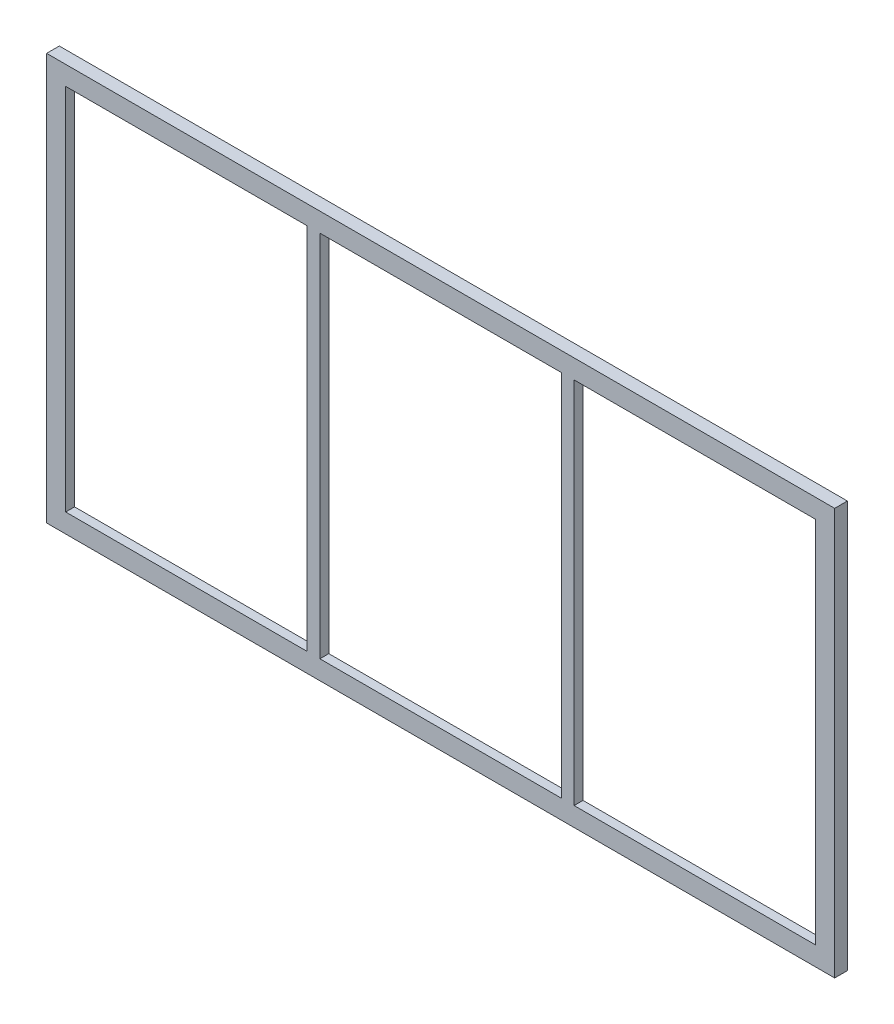
ISO-10303-21;
HEADER;
FILE_DESCRIPTION(('STEP AP214'),'2;1');
FILE_NAME('part.step','',(''),(''),'','','');
FILE_SCHEMA(('AUTOMOTIVE_DESIGN { 1 0 10303 214 1 1 1 1 }'));
ENDSEC;
DATA;
#1=APPLICATION_CONTEXT('core data for automotive mechanical design processes');
#2=APPLICATION_PROTOCOL_DEFINITION('international standard','automotive_design',2000,#1);
#3=PRODUCT_CONTEXT('',#1,'mechanical');
#4=PRODUCT('Part','Part','',(#3));
#5=PRODUCT_RELATED_PRODUCT_CATEGORY('part','',(#4));
#6=PRODUCT_DEFINITION_FORMATION('','',#4);
#7=PRODUCT_DEFINITION_CONTEXT('part definition',#1,'design');
#8=PRODUCT_DEFINITION('design','',#6,#7);
#9=PRODUCT_DEFINITION_SHAPE('','',#8);
#10=(LENGTH_UNIT() NAMED_UNIT(*) SI_UNIT(.MILLI.,.METRE.));
#11=(NAMED_UNIT(*) PLANE_ANGLE_UNIT() SI_UNIT($,.RADIAN.));
#12=(NAMED_UNIT(*) SI_UNIT($,.STERADIAN.) SOLID_ANGLE_UNIT());
#13=UNCERTAINTY_MEASURE_WITH_UNIT(LENGTH_MEASURE(1.E-05),#10,'distance_accuracy_value','');
#14=(GEOMETRIC_REPRESENTATION_CONTEXT(3) GLOBAL_UNCERTAINTY_ASSIGNED_CONTEXT((#13)) GLOBAL_UNIT_ASSIGNED_CONTEXT((#10,
#11,#12)) REPRESENTATION_CONTEXT('',''));
#15=CARTESIAN_POINT('',(0.,0.,0.));
#16=DIRECTION('',(0.,0.,1.));
#17=DIRECTION('',(1.,0.,0.));
#18=AXIS2_PLACEMENT_3D('',#15,#16,#17);
#19=CARTESIAN_POINT('',(5.,5.,10.));
#20=DIRECTION('',(1.,0.,0.));
#21=DIRECTION('',(0.,0.,-1.));
#22=AXIS2_PLACEMENT_3D('',#19,#20,#21);
#23=PLANE('',#22);
#24=DIRECTION('',(0.,0.,-1.));
#25=VECTOR('',#24,1.);
#26=CARTESIAN_POINT('',(5.,5.,10.));
#27=LINE('',#26,#25);
#28=CARTESIAN_POINT('',(5.,5.,10.));
#29=VERTEX_POINT('',#28);
#30=CARTESIAN_POINT('',(5.,5.,3.));
#31=VERTEX_POINT('',#30);
#32=EDGE_CURVE('E297',#29,#31,#27,.T.);
#33=ORIENTED_EDGE('',*,*,#32,.T.);
#34=DIRECTION('',(0.,1.,0.));
#35=VECTOR('',#34,1.);
#36=CARTESIAN_POINT('',(5.,5.,3.));
#37=LINE('',#36,#35);
#38=CARTESIAN_POINT('',(5.,295.,3.));
#39=VERTEX_POINT('',#38);
#40=EDGE_CURVE('E234',#31,#39,#37,.T.);
#41=ORIENTED_EDGE('',*,*,#40,.T.);
#42=DIRECTION('',(0.,0.,-1.));
#43=VECTOR('',#42,1.);
#44=CARTESIAN_POINT('',(5.,295.,10.));
#45=LINE('',#44,#43);
#46=CARTESIAN_POINT('',(5.,295.,10.));
#47=VERTEX_POINT('',#46);
#48=EDGE_CURVE('E288',#47,#39,#45,.T.);
#49=ORIENTED_EDGE('',*,*,#48,.F.);
#50=DIRECTION('',(0.,-1.,0.));
#51=VECTOR('',#50,1.);
#52=CARTESIAN_POINT('',(5.,5.,10.));
#53=LINE('',#52,#51);
#54=EDGE_CURVE('E279',#47,#29,#53,.T.);
#55=ORIENTED_EDGE('',*,*,#54,.T.);
#56=EDGE_LOOP('',(#33,#41,#49,#55));
#57=FACE_BOUND('',#56,.T.);
#58=ADVANCED_FACE('F32',(#57),#23,.T.);
#59=CARTESIAN_POINT('',(5.,5.,10.));
#60=DIRECTION('',(0.,1.,0.));
#61=DIRECTION('',(-1.,0.,0.));
#62=AXIS2_PLACEMENT_3D('',#59,#60,#61);
#63=PLANE('',#62);
#64=DIRECTION('',(0.,0.,-1.));
#65=VECTOR('',#64,1.);
#66=CARTESIAN_POINT('',(195.,5.,10.));
#67=LINE('',#66,#65);
#68=CARTESIAN_POINT('',(195.,5.,10.));
#69=VERTEX_POINT('',#68);
#70=CARTESIAN_POINT('',(195.,5.,3.));
#71=VERTEX_POINT('',#70);
#72=EDGE_CURVE('E294',#69,#71,#67,.T.);
#73=ORIENTED_EDGE('',*,*,#72,.T.);
#74=DIRECTION('',(-1.,0.,0.));
#75=VECTOR('',#74,1.);
#76=CARTESIAN_POINT('',(5.,5.,3.));
#77=LINE('',#76,#75);
#78=EDGE_CURVE('E231',#71,#31,#77,.T.);
#79=ORIENTED_EDGE('',*,*,#78,.T.);
#80=ORIENTED_EDGE('',*,*,#32,.F.);
#81=DIRECTION('',(1.,0.,0.));
#82=VECTOR('',#81,1.);
#83=CARTESIAN_POINT('',(5.,5.,10.));
#84=LINE('',#83,#82);
#85=EDGE_CURVE('E281',#29,#69,#84,.T.);
#86=ORIENTED_EDGE('',*,*,#85,.T.);
#87=EDGE_LOOP('',(#73,#79,#80,#86));
#88=FACE_BOUND('',#87,.T.);
#89=ADVANCED_FACE('F380',(#88),#63,.T.);
#90=CARTESIAN_POINT('',(195.,295.,10.));
#91=DIRECTION('',(-1.,0.,0.));
#92=DIRECTION('',(0.,0.,1.));
#93=AXIS2_PLACEMENT_3D('',#90,#91,#92);
#94=PLANE('',#93);
#95=DIRECTION('',(0.,0.,-1.));
#96=VECTOR('',#95,1.);
#97=CARTESIAN_POINT('',(195.,295.,10.));
#98=LINE('',#97,#96);
#99=CARTESIAN_POINT('',(195.,295.,10.));
#100=VERTEX_POINT('',#99);
#101=CARTESIAN_POINT('',(195.,295.,3.));
#102=VERTEX_POINT('',#101);
#103=EDGE_CURVE('E291',#100,#102,#98,.T.);
#104=ORIENTED_EDGE('',*,*,#103,.T.);
#105=DIRECTION('',(0.,-1.,0.));
#106=VECTOR('',#105,1.);
#107=CARTESIAN_POINT('',(195.,295.,3.));
#108=LINE('',#107,#106);
#109=EDGE_CURVE('E55',#102,#71,#108,.T.);
#110=ORIENTED_EDGE('',*,*,#109,.T.);
#111=ORIENTED_EDGE('',*,*,#72,.F.);
#112=DIRECTION('',(0.,1.,0.));
#113=VECTOR('',#112,1.);
#114=CARTESIAN_POINT('',(195.,295.,10.));
#115=LINE('',#114,#113);
#116=EDGE_CURVE('E283',#69,#100,#115,.T.);
#117=ORIENTED_EDGE('',*,*,#116,.T.);
#118=EDGE_LOOP('',(#104,#110,#111,#117));
#119=FACE_BOUND('',#118,.T.);
#120=ADVANCED_FACE('F386',(#119),#94,.T.);
#121=CARTESIAN_POINT('',(5.,295.,10.));
#122=DIRECTION('',(0.,-1.,0.));
#123=DIRECTION('',(0.,0.,-1.));
#124=AXIS2_PLACEMENT_3D('',#121,#122,#123);
#125=PLANE('',#124);
#126=ORIENTED_EDGE('',*,*,#48,.T.);
#127=DIRECTION('',(1.,0.,0.));
#128=VECTOR('',#127,1.);
#129=CARTESIAN_POINT('',(5.,295.,3.));
#130=LINE('',#129,#128);
#131=EDGE_CURVE('E228',#39,#102,#130,.T.);
#132=ORIENTED_EDGE('',*,*,#131,.T.);
#133=ORIENTED_EDGE('',*,*,#103,.F.);
#134=DIRECTION('',(-1.,0.,0.));
#135=VECTOR('',#134,1.);
#136=CARTESIAN_POINT('',(5.,295.,10.));
#137=LINE('',#136,#135);
#138=EDGE_CURVE('E286',#100,#47,#137,.T.);
#139=ORIENTED_EDGE('',*,*,#138,.T.);
#140=EDGE_LOOP('',(#126,#132,#133,#139));
#141=FACE_BOUND('',#140,.T.);
#142=ADVANCED_FACE('F491',(#141),#125,.T.);
#143=CARTESIAN_POINT('',(405.,295.,10.));
#144=DIRECTION('',(0.,-1.,0.));
#145=DIRECTION('',(0.,0.,-1.));
#146=AXIS2_PLACEMENT_3D('',#143,#144,#145);
#147=PLANE('',#146);
#148=DIRECTION('',(0.,0.,-1.));
#149=VECTOR('',#148,1.);
#150=CARTESIAN_POINT('',(405.,295.,10.));
#151=LINE('',#150,#149);
#152=CARTESIAN_POINT('',(405.,295.,10.));
#153=VERTEX_POINT('',#152);
#154=CARTESIAN_POINT('',(405.,295.,3.));
#155=VERTEX_POINT('',#154);
#156=EDGE_CURVE('E276',#153,#155,#151,.T.);
#157=ORIENTED_EDGE('',*,*,#156,.T.);
#158=DIRECTION('',(1.,0.,0.));
#159=VECTOR('',#158,1.);
#160=CARTESIAN_POINT('',(405.,295.,3.));
#161=LINE('',#160,#159);
#162=CARTESIAN_POINT('',(595.,295.,3.));
#163=VERTEX_POINT('',#162);
#164=EDGE_CURVE('E225',#155,#163,#161,.T.);
#165=ORIENTED_EDGE('',*,*,#164,.T.);
#166=DIRECTION('',(0.,0.,-1.));
#167=VECTOR('',#166,1.);
#168=CARTESIAN_POINT('',(595.,295.,10.));
#169=LINE('',#168,#167);
#170=CARTESIAN_POINT('',(595.,295.,10.));
#171=VERTEX_POINT('',#170);
#172=EDGE_CURVE('E267',#171,#163,#169,.T.);
#173=ORIENTED_EDGE('',*,*,#172,.F.);
#174=DIRECTION('',(-1.,0.,0.));
#175=VECTOR('',#174,1.);
#176=CARTESIAN_POINT('',(405.,295.,10.));
#177=LINE('',#176,#175);
#178=EDGE_CURVE('E258',#171,#153,#177,.T.);
#179=ORIENTED_EDGE('',*,*,#178,.T.);
#180=EDGE_LOOP('',(#157,#165,#173,#179));
#181=FACE_BOUND('',#180,.T.);
#182=ADVANCED_FACE('F482',(#181),#147,.T.);
#183=CARTESIAN_POINT('',(405.,295.,10.));
#184=DIRECTION('',(1.,0.,0.));
#185=DIRECTION('',(0.,0.,-1.));
#186=AXIS2_PLACEMENT_3D('',#183,#184,#185);
#187=PLANE('',#186);
#188=DIRECTION('',(0.,0.,-1.));
#189=VECTOR('',#188,1.);
#190=CARTESIAN_POINT('',(405.,5.,10.));
#191=LINE('',#190,#189);
#192=CARTESIAN_POINT('',(405.,5.,10.));
#193=VERTEX_POINT('',#192);
#194=CARTESIAN_POINT('',(405.,5.,3.));
#195=VERTEX_POINT('',#194);
#196=EDGE_CURVE('E273',#193,#195,#191,.T.);
#197=ORIENTED_EDGE('',*,*,#196,.T.);
#198=DIRECTION('',(0.,1.,0.));
#199=VECTOR('',#198,1.);
#200=CARTESIAN_POINT('',(405.,295.,3.));
#201=LINE('',#200,#199);
#202=EDGE_CURVE('E222',#195,#155,#201,.T.);
#203=ORIENTED_EDGE('',*,*,#202,.T.);
#204=ORIENTED_EDGE('',*,*,#156,.F.);
#205=DIRECTION('',(0.,-1.,0.));
#206=VECTOR('',#205,1.);
#207=CARTESIAN_POINT('',(405.,295.,10.));
#208=LINE('',#207,#206);
#209=EDGE_CURVE('E260',#153,#193,#208,.T.);
#210=ORIENTED_EDGE('',*,*,#209,.T.);
#211=EDGE_LOOP('',(#197,#203,#204,#210));
#212=FACE_BOUND('',#211,.T.);
#213=ADVANCED_FACE('F473',(#212),#187,.T.);
#214=CARTESIAN_POINT('',(405.,5.,10.));
#215=DIRECTION('',(0.,1.,0.));
#216=DIRECTION('',(-1.,0.,0.));
#217=AXIS2_PLACEMENT_3D('',#214,#215,#216);
#218=PLANE('',#217);
#219=DIRECTION('',(0.,0.,-1.));
#220=VECTOR('',#219,1.);
#221=CARTESIAN_POINT('',(595.,5.,10.));
#222=LINE('',#221,#220);
#223=CARTESIAN_POINT('',(595.,5.,10.));
#224=VERTEX_POINT('',#223);
#225=CARTESIAN_POINT('',(595.,5.,3.));
#226=VERTEX_POINT('',#225);
#227=EDGE_CURVE('E270',#224,#226,#222,.T.);
#228=ORIENTED_EDGE('',*,*,#227,.T.);
#229=DIRECTION('',(-1.,0.,0.));
#230=VECTOR('',#229,1.);
#231=CARTESIAN_POINT('',(405.,5.,3.));
#232=LINE('',#231,#230);
#233=EDGE_CURVE('E219',#226,#195,#232,.T.);
#234=ORIENTED_EDGE('',*,*,#233,.T.);
#235=ORIENTED_EDGE('',*,*,#196,.F.);
#236=DIRECTION('',(1.,0.,0.));
#237=VECTOR('',#236,1.);
#238=CARTESIAN_POINT('',(405.,5.,10.));
#239=LINE('',#238,#237);
#240=EDGE_CURVE('E262',#193,#224,#239,.T.);
#241=ORIENTED_EDGE('',*,*,#240,.T.);
#242=EDGE_LOOP('',(#228,#234,#235,#241));
#243=FACE_BOUND('',#242,.T.);
#244=ADVANCED_FACE('F464',(#243),#218,.T.);
#245=CARTESIAN_POINT('',(595.,5.,10.));
#246=DIRECTION('',(-1.,0.,0.));
#247=DIRECTION('',(0.,0.,1.));
#248=AXIS2_PLACEMENT_3D('',#245,#246,#247);
#249=PLANE('',#248);
#250=ORIENTED_EDGE('',*,*,#172,.T.);
#251=DIRECTION('',(0.,-1.,0.));
#252=VECTOR('',#251,1.);
#253=CARTESIAN_POINT('',(595.,5.,3.));
#254=LINE('',#253,#252);
#255=EDGE_CURVE('E216',#163,#226,#254,.T.);
#256=ORIENTED_EDGE('',*,*,#255,.T.);
#257=ORIENTED_EDGE('',*,*,#227,.F.);
#258=DIRECTION('',(0.,1.,0.));
#259=VECTOR('',#258,1.);
#260=CARTESIAN_POINT('',(595.,5.,10.));
#261=LINE('',#260,#259);
#262=EDGE_CURVE('E265',#224,#171,#261,.T.);
#263=ORIENTED_EDGE('',*,*,#262,.T.);
#264=EDGE_LOOP('',(#250,#256,#257,#263));
#265=FACE_BOUND('',#264,.T.);
#266=ADVANCED_FACE('F456',(#265),#249,.T.);
#267=CARTESIAN_POINT('',(205.,295.,10.));
#268=DIRECTION('',(0.,-1.,0.));
#269=DIRECTION('',(0.,0.,-1.));
#270=AXIS2_PLACEMENT_3D('',#267,#268,#269);
#271=PLANE('',#270);
#272=DIRECTION('',(0.,0.,-1.));
#273=VECTOR('',#272,1.);
#274=CARTESIAN_POINT('',(205.,295.,10.));
#275=LINE('',#274,#273);
#276=CARTESIAN_POINT('',(205.,295.,10.));
#277=VERTEX_POINT('',#276);
#278=CARTESIAN_POINT('',(205.,295.,3.));
#279=VERTEX_POINT('',#278);
#280=EDGE_CURVE('E255',#277,#279,#275,.T.);
#281=ORIENTED_EDGE('',*,*,#280,.T.);
#282=DIRECTION('',(1.,0.,0.));
#283=VECTOR('',#282,1.);
#284=CARTESIAN_POINT('',(205.,295.,3.));
#285=LINE('',#284,#283);
#286=CARTESIAN_POINT('',(395.,295.,3.));
#287=VERTEX_POINT('',#286);
#288=EDGE_CURVE('E213',#279,#287,#285,.T.);
#289=ORIENTED_EDGE('',*,*,#288,.T.);
#290=DIRECTION('',(0.,0.,-1.));
#291=VECTOR('',#290,1.);
#292=CARTESIAN_POINT('',(395.,295.,10.));
#293=LINE('',#292,#291);
#294=CARTESIAN_POINT('',(395.,295.,10.));
#295=VERTEX_POINT('',#294);
#296=EDGE_CURVE('E246',#295,#287,#293,.T.);
#297=ORIENTED_EDGE('',*,*,#296,.F.);
#298=DIRECTION('',(-1.,0.,0.));
#299=VECTOR('',#298,1.);
#300=CARTESIAN_POINT('',(205.,295.,10.));
#301=LINE('',#300,#299);
#302=EDGE_CURVE('E237',#295,#277,#301,.T.);
#303=ORIENTED_EDGE('',*,*,#302,.T.);
#304=EDGE_LOOP('',(#281,#289,#297,#303));
#305=FACE_BOUND('',#304,.T.);
#306=ADVANCED_FACE('F364',(#305),#271,.T.);
#307=CARTESIAN_POINT('',(205.,295.,10.));
#308=DIRECTION('',(1.,0.,0.));
#309=DIRECTION('',(0.,0.,-1.));
#310=AXIS2_PLACEMENT_3D('',#307,#308,#309);
#311=PLANE('',#310);
#312=DIRECTION('',(0.,0.,-1.));
#313=VECTOR('',#312,1.);
#314=CARTESIAN_POINT('',(205.,5.,10.));
#315=LINE('',#314,#313);
#316=CARTESIAN_POINT('',(205.,5.,10.));
#317=VERTEX_POINT('',#316);
#318=CARTESIAN_POINT('',(205.,5.,3.));
#319=VERTEX_POINT('',#318);
#320=EDGE_CURVE('E252',#317,#319,#315,.T.);
#321=ORIENTED_EDGE('',*,*,#320,.T.);
#322=DIRECTION('',(0.,1.,0.));
#323=VECTOR('',#322,1.);
#324=CARTESIAN_POINT('',(205.,295.,3.));
#325=LINE('',#324,#323);
#326=EDGE_CURVE('E210',#319,#279,#325,.T.);
#327=ORIENTED_EDGE('',*,*,#326,.T.);
#328=ORIENTED_EDGE('',*,*,#280,.F.);
#329=DIRECTION('',(0.,-1.,0.));
#330=VECTOR('',#329,1.);
#331=CARTESIAN_POINT('',(205.,295.,10.));
#332=LINE('',#331,#330);
#333=EDGE_CURVE('E239',#277,#317,#332,.T.);
#334=ORIENTED_EDGE('',*,*,#333,.T.);
#335=EDGE_LOOP('',(#321,#327,#328,#334));
#336=FACE_BOUND('',#335,.T.);
#337=ADVANCED_FACE('F366',(#336),#311,.T.);
#338=CARTESIAN_POINT('',(205.,5.,10.));
#339=DIRECTION('',(0.,1.,0.));
#340=DIRECTION('',(0.,0.,1.));
#341=AXIS2_PLACEMENT_3D('',#338,#339,#340);
#342=PLANE('',#341);
#343=DIRECTION('',(0.,0.,-1.));
#344=VECTOR('',#343,1.);
#345=CARTESIAN_POINT('',(395.,5.,10.));
#346=LINE('',#345,#344);
#347=CARTESIAN_POINT('',(395.,5.,10.));
#348=VERTEX_POINT('',#347);
#349=CARTESIAN_POINT('',(395.,5.,3.));
#350=VERTEX_POINT('',#349);
#351=EDGE_CURVE('E249',#348,#350,#346,.T.);
#352=ORIENTED_EDGE('',*,*,#351,.T.);
#353=DIRECTION('',(-1.,0.,0.));
#354=VECTOR('',#353,1.);
#355=CARTESIAN_POINT('',(205.,5.,3.));
#356=LINE('',#355,#354);
#357=EDGE_CURVE('E204',#350,#319,#356,.T.);
#358=ORIENTED_EDGE('',*,*,#357,.T.);
#359=ORIENTED_EDGE('',*,*,#320,.F.);
#360=DIRECTION('',(1.,0.,0.));
#361=VECTOR('',#360,1.);
#362=CARTESIAN_POINT('',(205.,5.,10.));
#363=LINE('',#362,#361);
#364=EDGE_CURVE('E241',#317,#348,#363,.T.);
#365=ORIENTED_EDGE('',*,*,#364,.T.);
#366=EDGE_LOOP('',(#352,#358,#359,#365));
#367=FACE_BOUND('',#366,.T.);
#368=ADVANCED_FACE('F370',(#367),#342,.T.);
#369=CARTESIAN_POINT('',(395.,295.,10.));
#370=DIRECTION('',(-1.,0.,0.));
#371=DIRECTION('',(0.,0.,1.));
#372=AXIS2_PLACEMENT_3D('',#369,#370,#371);
#373=PLANE('',#372);
#374=ORIENTED_EDGE('',*,*,#296,.T.);
#375=DIRECTION('',(0.,-1.,0.));
#376=VECTOR('',#375,1.);
#377=CARTESIAN_POINT('',(395.,295.,3.));
#378=LINE('',#377,#376);
#379=EDGE_CURVE('E11',#287,#350,#378,.T.);
#380=ORIENTED_EDGE('',*,*,#379,.T.);
#381=ORIENTED_EDGE('',*,*,#351,.F.);
#382=DIRECTION('',(0.,1.,0.));
#383=VECTOR('',#382,1.);
#384=CARTESIAN_POINT('',(395.,295.,10.));
#385=LINE('',#384,#383);
#386=EDGE_CURVE('E244',#348,#295,#385,.T.);
#387=ORIENTED_EDGE('',*,*,#386,.T.);
#388=EDGE_LOOP('',(#374,#380,#381,#387));
#389=FACE_BOUND('',#388,.T.);
#390=ADVANCED_FACE('F350',(#389),#373,.T.);
#391=CARTESIAN_POINT('',(0.,0.,10.));
#392=DIRECTION('',(0.,0.,-1.));
#393=DIRECTION('',(-1.,0.,0.));
#394=AXIS2_PLACEMENT_3D('',#391,#392,#393);
#395=PLANE('',#394);
#396=ORIENTED_EDGE('',*,*,#178,.F.);
#397=ORIENTED_EDGE('',*,*,#262,.F.);
#398=ORIENTED_EDGE('',*,*,#240,.F.);
#399=ORIENTED_EDGE('',*,*,#209,.F.);
#400=EDGE_LOOP('',(#396,#397,#398,#399));
#401=FACE_BOUND('',#400,.T.);
#402=DIRECTION('',(0.,-1.,0.));
#403=VECTOR('',#402,1.);
#404=CARTESIAN_POINT('',(-10.,-10.,10.));
#405=LINE('',#404,#403);
#406=CARTESIAN_POINT('',(-10.,310.,10.));
#407=VERTEX_POINT('',#406);
#408=CARTESIAN_POINT('',(-10.,-10.,10.));
#409=VERTEX_POINT('',#408);
#410=EDGE_CURVE('E301',#407,#409,#405,.T.);
#411=ORIENTED_EDGE('',*,*,#410,.T.);
#412=DIRECTION('',(1.,0.,0.));
#413=VECTOR('',#412,1.);
#414=CARTESIAN_POINT('',(-10.,-10.,10.));
#415=LINE('',#414,#413);
#416=CARTESIAN_POINT('',(610.,-10.,10.));
#417=VERTEX_POINT('',#416);
#418=EDGE_CURVE('E304',#409,#417,#415,.T.);
#419=ORIENTED_EDGE('',*,*,#418,.T.);
#420=DIRECTION('',(0.,1.,0.));
#421=VECTOR('',#420,1.);
#422=CARTESIAN_POINT('',(610.,-10.,10.));
#423=LINE('',#422,#421);
#424=CARTESIAN_POINT('',(610.,310.,10.));
#425=VERTEX_POINT('',#424);
#426=EDGE_CURVE('E307',#417,#425,#423,.T.);
#427=ORIENTED_EDGE('',*,*,#426,.T.);
#428=DIRECTION('',(-1.,0.,0.));
#429=VECTOR('',#428,1.);
#430=CARTESIAN_POINT('',(-10.,310.,10.));
#431=LINE('',#430,#429);
#432=EDGE_CURVE('E309',#425,#407,#431,.T.);
#433=ORIENTED_EDGE('',*,*,#432,.T.);
#434=EDGE_LOOP('',(#411,#419,#427,#433));
#435=FACE_BOUND('',#434,.T.);
#436=ORIENTED_EDGE('',*,*,#54,.F.);
#437=ORIENTED_EDGE('',*,*,#138,.F.);
#438=ORIENTED_EDGE('',*,*,#116,.F.);
#439=ORIENTED_EDGE('',*,*,#85,.F.);
#440=EDGE_LOOP('',(#436,#437,#438,#439));
#441=FACE_BOUND('',#440,.T.);
#442=ORIENTED_EDGE('',*,*,#302,.F.);
#443=ORIENTED_EDGE('',*,*,#386,.F.);
#444=ORIENTED_EDGE('',*,*,#364,.F.);
#445=ORIENTED_EDGE('',*,*,#333,.F.);
#446=EDGE_LOOP('',(#442,#443,#444,#445));
#447=FACE_BOUND('',#446,.T.);
#448=ADVANCED_FACE('F347',(#401,#435,#441,#447),#395,.F.);
#449=CARTESIAN_POINT('',(0.,0.,0.));
#450=DIRECTION('',(0.,0.,-1.));
#451=DIRECTION('',(-1.,0.,0.));
#452=AXIS2_PLACEMENT_3D('',#449,#450,#451);
#453=PLANE('',#452);
#454=DIRECTION('',(0.,1.,0.));
#455=VECTOR('',#454,1.);
#456=CARTESIAN_POINT('',(0.,0.,0.));
#457=LINE('',#456,#455);
#458=CARTESIAN_POINT('',(0.,0.,0.));
#459=VERTEX_POINT('',#458);
#460=CARTESIAN_POINT('',(0.,300.,0.));
#461=VERTEX_POINT('',#460);
#462=EDGE_CURVE('E47',#459,#461,#457,.T.);
#463=ORIENTED_EDGE('',*,*,#462,.F.);
#464=DIRECTION('',(-1.,0.,0.));
#465=VECTOR('',#464,1.);
#466=CARTESIAN_POINT('',(0.,0.,0.));
#467=LINE('',#466,#465);
#468=CARTESIAN_POINT('',(600.,0.,0.));
#469=VERTEX_POINT('',#468);
#470=EDGE_CURVE('E189',#469,#459,#467,.T.);
#471=ORIENTED_EDGE('',*,*,#470,.F.);
#472=DIRECTION('',(0.,-1.,0.));
#473=VECTOR('',#472,1.);
#474=CARTESIAN_POINT('',(600.,0.,0.));
#475=LINE('',#474,#473);
#476=CARTESIAN_POINT('',(600.,300.,0.));
#477=VERTEX_POINT('',#476);
#478=EDGE_CURVE('E192',#477,#469,#475,.T.);
#479=ORIENTED_EDGE('',*,*,#478,.F.);
#480=DIRECTION('',(1.,0.,0.));
#481=VECTOR('',#480,1.);
#482=CARTESIAN_POINT('',(0.,300.,0.));
#483=LINE('',#482,#481);
#484=EDGE_CURVE('E198',#461,#477,#483,.T.);
#485=ORIENTED_EDGE('',*,*,#484,.F.);
#486=EDGE_LOOP('',(#463,#471,#479,#485));
#487=FACE_BOUND('',#486,.T.);
#488=DIRECTION('',(0.,-1.,0.));
#489=VECTOR('',#488,1.);
#490=CARTESIAN_POINT('',(-10.,-10.,0.));
#491=LINE('',#490,#489);
#492=CARTESIAN_POINT('',(-10.,310.,0.));
#493=VERTEX_POINT('',#492);
#494=CARTESIAN_POINT('',(-10.,-10.,0.));
#495=VERTEX_POINT('',#494);
#496=EDGE_CURVE('E300',#493,#495,#491,.T.);
#497=ORIENTED_EDGE('',*,*,#496,.F.);
#498=DIRECTION('',(-1.,0.,0.));
#499=VECTOR('',#498,1.);
#500=CARTESIAN_POINT('',(-10.,310.,0.));
#501=LINE('',#500,#499);
#502=CARTESIAN_POINT('',(610.,310.,0.));
#503=VERTEX_POINT('',#502);
#504=EDGE_CURVE('E305',#503,#493,#501,.T.);
#505=ORIENTED_EDGE('',*,*,#504,.F.);
#506=DIRECTION('',(0.,1.,0.));
#507=VECTOR('',#506,1.);
#508=CARTESIAN_POINT('',(610.,-10.,0.));
#509=LINE('',#508,#507);
#510=CARTESIAN_POINT('',(610.,-10.,0.));
#511=VERTEX_POINT('',#510);
#512=EDGE_CURVE('E316',#511,#503,#509,.T.);
#513=ORIENTED_EDGE('',*,*,#512,.F.);
#514=DIRECTION('',(1.,0.,0.));
#515=VECTOR('',#514,1.);
#516=CARTESIAN_POINT('',(-10.,-10.,0.));
#517=LINE('',#516,#515);
#518=EDGE_CURVE('E314',#495,#511,#517,.T.);
#519=ORIENTED_EDGE('',*,*,#518,.F.);
#520=EDGE_LOOP('',(#497,#505,#513,#519));
#521=FACE_BOUND('',#520,.T.);
#522=ADVANCED_FACE('F337',(#487,#521),#453,.T.);
#523=CARTESIAN_POINT('',(-10.,-10.,10.));
#524=DIRECTION('',(1.,0.,0.));
#525=DIRECTION('',(0.,0.,-1.));
#526=AXIS2_PLACEMENT_3D('',#523,#524,#525);
#527=PLANE('',#526);
#528=ORIENTED_EDGE('',*,*,#496,.T.);
#529=DIRECTION('',(0.,0.,-1.));
#530=VECTOR('',#529,1.);
#531=CARTESIAN_POINT('',(-10.,-10.,10.));
#532=LINE('',#531,#530);
#533=EDGE_CURVE('E40',#409,#495,#532,.T.);
#534=ORIENTED_EDGE('',*,*,#533,.F.);
#535=ORIENTED_EDGE('',*,*,#410,.F.);
#536=DIRECTION('',(0.,0.,-1.));
#537=VECTOR('',#536,1.);
#538=CARTESIAN_POINT('',(-10.,310.,10.));
#539=LINE('',#538,#537);
#540=EDGE_CURVE('E311',#407,#493,#539,.T.);
#541=ORIENTED_EDGE('',*,*,#540,.T.);
#542=EDGE_LOOP('',(#528,#534,#535,#541));
#543=FACE_BOUND('',#542,.T.);
#544=ADVANCED_FACE('F34',(#543),#527,.F.);
#545=CARTESIAN_POINT('',(-10.,-10.,10.));
#546=DIRECTION('',(0.,1.,0.));
#547=DIRECTION('',(0.,0.,1.));
#548=AXIS2_PLACEMENT_3D('',#545,#546,#547);
#549=PLANE('',#548);
#550=ORIENTED_EDGE('',*,*,#518,.T.);
#551=DIRECTION('',(0.,0.,-1.));
#552=VECTOR('',#551,1.);
#553=CARTESIAN_POINT('',(610.,-10.,10.));
#554=LINE('',#553,#552);
#555=EDGE_CURVE('E324',#417,#511,#554,.T.);
#556=ORIENTED_EDGE('',*,*,#555,.F.);
#557=ORIENTED_EDGE('',*,*,#418,.F.);
#558=ORIENTED_EDGE('',*,*,#533,.T.);
#559=EDGE_LOOP('',(#550,#556,#557,#558));
#560=FACE_BOUND('',#559,.T.);
#561=ADVANCED_FACE('F329',(#560),#549,.F.);
#562=CARTESIAN_POINT('',(610.,-10.,10.));
#563=DIRECTION('',(-1.,0.,0.));
#564=DIRECTION('',(0.,0.,1.));
#565=AXIS2_PLACEMENT_3D('',#562,#563,#564);
#566=PLANE('',#565);
#567=ORIENTED_EDGE('',*,*,#512,.T.);
#568=DIRECTION('',(0.,0.,-1.));
#569=VECTOR('',#568,1.);
#570=CARTESIAN_POINT('',(610.,310.,10.));
#571=LINE('',#570,#569);
#572=EDGE_CURVE('E321',#425,#503,#571,.T.);
#573=ORIENTED_EDGE('',*,*,#572,.F.);
#574=ORIENTED_EDGE('',*,*,#426,.F.);
#575=ORIENTED_EDGE('',*,*,#555,.T.);
#576=EDGE_LOOP('',(#567,#573,#574,#575));
#577=FACE_BOUND('',#576,.T.);
#578=ADVANCED_FACE('F341',(#577),#566,.F.);
#579=CARTESIAN_POINT('',(-10.,310.,10.));
#580=DIRECTION('',(0.,-1.,0.));
#581=DIRECTION('',(0.,0.,-1.));
#582=AXIS2_PLACEMENT_3D('',#579,#580,#581);
#583=PLANE('',#582);
#584=ORIENTED_EDGE('',*,*,#504,.T.);
#585=ORIENTED_EDGE('',*,*,#540,.F.);
#586=ORIENTED_EDGE('',*,*,#432,.F.);
#587=ORIENTED_EDGE('',*,*,#572,.T.);
#588=EDGE_LOOP('',(#584,#585,#586,#587));
#589=FACE_BOUND('',#588,.T.);
#590=ADVANCED_FACE('F345',(#589),#583,.F.);
#591=CARTESIAN_POINT('',(0.,0.,3.));
#592=DIRECTION('',(-1.,0.,0.));
#593=DIRECTION('',(0.,0.,1.));
#594=AXIS2_PLACEMENT_3D('',#591,#592,#593);
#595=PLANE('',#594);
#596=ORIENTED_EDGE('',*,*,#462,.T.);
#597=DIRECTION('',(0.,0.,-1.));
#598=VECTOR('',#597,1.);
#599=CARTESIAN_POINT('',(0.,300.,3.));
#600=LINE('',#599,#598);
#601=CARTESIAN_POINT('',(0.,300.,3.));
#602=VERTEX_POINT('',#601);
#603=EDGE_CURVE('E167',#602,#461,#600,.T.);
#604=ORIENTED_EDGE('',*,*,#603,.F.);
#605=DIRECTION('',(0.,1.,0.));
#606=VECTOR('',#605,1.);
#607=CARTESIAN_POINT('',(0.,0.,3.));
#608=LINE('',#607,#606);
#609=CARTESIAN_POINT('',(0.,0.,3.));
#610=VERTEX_POINT('',#609);
#611=EDGE_CURVE('E171',#610,#602,#608,.T.);
#612=ORIENTED_EDGE('',*,*,#611,.F.);
#613=DIRECTION('',(0.,0.,-1.));
#614=VECTOR('',#613,1.);
#615=CARTESIAN_POINT('',(0.,0.,3.));
#616=LINE('',#615,#614);
#617=EDGE_CURVE('E202',#610,#459,#616,.T.);
#618=ORIENTED_EDGE('',*,*,#617,.T.);
#619=EDGE_LOOP('',(#596,#604,#612,#618));
#620=FACE_BOUND('',#619,.T.);
#621=ADVANCED_FACE('F169',(#620),#595,.F.);
#622=CARTESIAN_POINT('',(0.,0.,3.));
#623=DIRECTION('',(0.,-1.,0.));
#624=DIRECTION('',(1.,0.,0.));
#625=AXIS2_PLACEMENT_3D('',#622,#623,#624);
#626=PLANE('',#625);
#627=ORIENTED_EDGE('',*,*,#470,.T.);
#628=ORIENTED_EDGE('',*,*,#617,.F.);
#629=DIRECTION('',(-1.,0.,0.));
#630=VECTOR('',#629,1.);
#631=CARTESIAN_POINT('',(0.,0.,3.));
#632=LINE('',#631,#630);
#633=CARTESIAN_POINT('',(600.,0.,3.));
#634=VERTEX_POINT('',#633);
#635=EDGE_CURVE('E177',#634,#610,#632,.T.);
#636=ORIENTED_EDGE('',*,*,#635,.F.);
#637=DIRECTION('',(0.,0.,-1.));
#638=VECTOR('',#637,1.);
#639=CARTESIAN_POINT('',(600.,0.,3.));
#640=LINE('',#639,#638);
#641=EDGE_CURVE('E205',#634,#469,#640,.T.);
#642=ORIENTED_EDGE('',*,*,#641,.T.);
#643=EDGE_LOOP('',(#627,#628,#636,#642));
#644=FACE_BOUND('',#643,.T.);
#645=ADVANCED_FACE('F523',(#644),#626,.F.);
#646=CARTESIAN_POINT('',(600.,0.,3.));
#647=DIRECTION('',(1.,0.,0.));
#648=DIRECTION('',(0.,0.,-1.));
#649=AXIS2_PLACEMENT_3D('',#646,#647,#648);
#650=PLANE('',#649);
#651=ORIENTED_EDGE('',*,*,#478,.T.);
#652=ORIENTED_EDGE('',*,*,#641,.F.);
#653=DIRECTION('',(0.,-1.,0.));
#654=VECTOR('',#653,1.);
#655=CARTESIAN_POINT('',(600.,0.,3.));
#656=LINE('',#655,#654);
#657=CARTESIAN_POINT('',(600.,300.,3.));
#658=VERTEX_POINT('',#657);
#659=EDGE_CURVE('E185',#658,#634,#656,.T.);
#660=ORIENTED_EDGE('',*,*,#659,.F.);
#661=DIRECTION('',(0.,0.,-1.));
#662=VECTOR('',#661,1.);
#663=CARTESIAN_POINT('',(600.,300.,3.));
#664=LINE('',#663,#662);
#665=EDGE_CURVE('E176',#658,#477,#664,.T.);
#666=ORIENTED_EDGE('',*,*,#665,.T.);
#667=EDGE_LOOP('',(#651,#652,#660,#666));
#668=FACE_BOUND('',#667,.T.);
#669=ADVANCED_FACE('F530',(#668),#650,.F.);
#670=CARTESIAN_POINT('',(0.,300.,3.));
#671=DIRECTION('',(0.,1.,0.));
#672=DIRECTION('',(-1.,0.,0.));
#673=AXIS2_PLACEMENT_3D('',#670,#671,#672);
#674=PLANE('',#673);
#675=ORIENTED_EDGE('',*,*,#484,.T.);
#676=ORIENTED_EDGE('',*,*,#665,.F.);
#677=DIRECTION('',(1.,0.,0.));
#678=VECTOR('',#677,1.);
#679=CARTESIAN_POINT('',(0.,300.,3.));
#680=LINE('',#679,#678);
#681=EDGE_CURVE('E180',#602,#658,#680,.T.);
#682=ORIENTED_EDGE('',*,*,#681,.F.);
#683=ORIENTED_EDGE('',*,*,#603,.T.);
#684=EDGE_LOOP('',(#675,#676,#682,#683));
#685=FACE_BOUND('',#684,.T.);
#686=ADVANCED_FACE('F181',(#685),#674,.F.);
#687=CARTESIAN_POINT('',(0.,0.,3.));
#688=DIRECTION('',(0.,0.,-1.));
#689=DIRECTION('',(-1.,0.,0.));
#690=AXIS2_PLACEMENT_3D('',#687,#688,#689);
#691=PLANE('',#690);
#692=ORIENTED_EDGE('',*,*,#78,.F.);
#693=ORIENTED_EDGE('',*,*,#109,.F.);
#694=ORIENTED_EDGE('',*,*,#131,.F.);
#695=ORIENTED_EDGE('',*,*,#40,.F.);
#696=EDGE_LOOP('',(#692,#693,#694,#695));
#697=FACE_BOUND('',#696,.T.);
#698=ORIENTED_EDGE('',*,*,#202,.F.);
#699=ORIENTED_EDGE('',*,*,#233,.F.);
#700=ORIENTED_EDGE('',*,*,#255,.F.);
#701=ORIENTED_EDGE('',*,*,#164,.F.);
#702=EDGE_LOOP('',(#698,#699,#700,#701));
#703=FACE_BOUND('',#702,.T.);
#704=ORIENTED_EDGE('',*,*,#326,.F.);
#705=ORIENTED_EDGE('',*,*,#357,.F.);
#706=ORIENTED_EDGE('',*,*,#379,.F.);
#707=ORIENTED_EDGE('',*,*,#288,.F.);
#708=EDGE_LOOP('',(#704,#705,#706,#707));
#709=FACE_BOUND('',#708,.T.);
#710=ORIENTED_EDGE('',*,*,#611,.T.);
#711=ORIENTED_EDGE('',*,*,#681,.T.);
#712=ORIENTED_EDGE('',*,*,#659,.T.);
#713=ORIENTED_EDGE('',*,*,#635,.T.);
#714=EDGE_LOOP('',(#710,#711,#712,#713));
#715=FACE_BOUND('',#714,.T.);
#716=ADVANCED_FACE('F187',(#697,#703,#709,#715),#691,.T.);
#717=CLOSED_SHELL('',(#58,#89,#120,#142,#182,#213,#244,#266,#306,#337,#368,#390,#448,#522,#544,
#561,#578,#590,#621,#645,#669,#686,#716));
#718=MANIFOLD_SOLID_BREP('B2',#717);
#719=ADVANCED_BREP_SHAPE_REPRESENTATION('',(#18,#718),#14);
#720=SHAPE_DEFINITION_REPRESENTATION(#9,#719);
ENDSEC;
END-ISO-10303-21;
